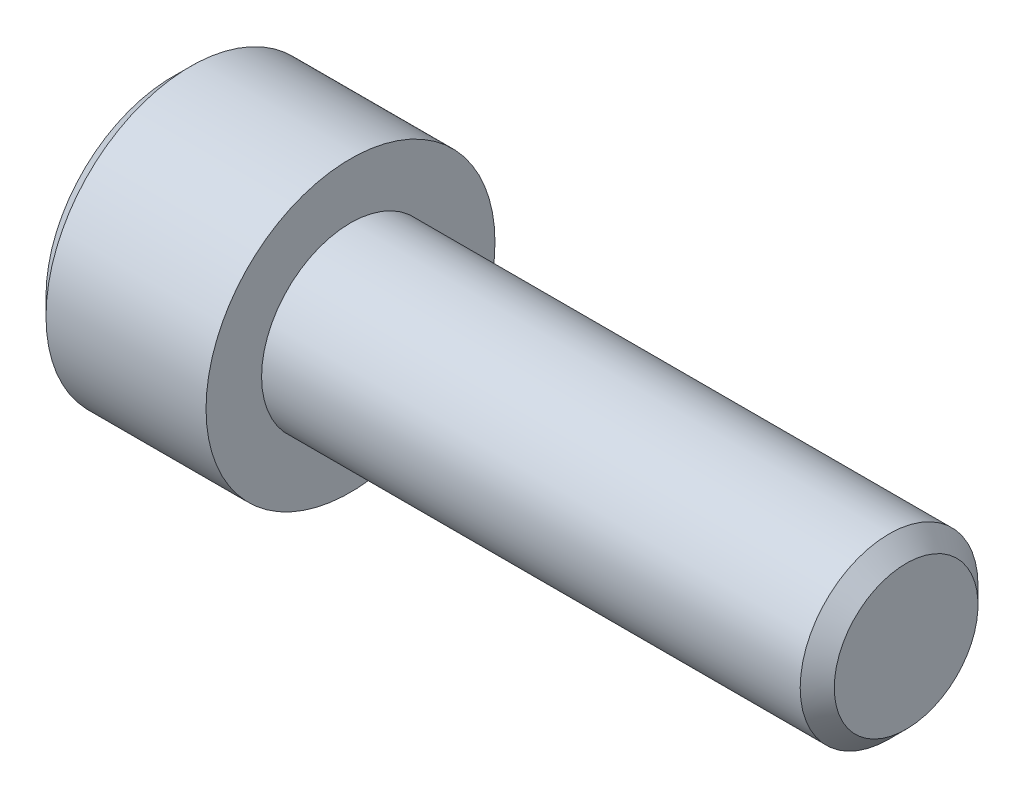
ISO-10303-21;
HEADER;
FILE_DESCRIPTION(('STEP AP214'),'2;1');
FILE_NAME('part.step','',(''),(''),'','','');
FILE_SCHEMA(('AUTOMOTIVE_DESIGN { 1 0 10303 214 1 1 1 1 }'));
ENDSEC;
DATA;
#1=APPLICATION_CONTEXT('core data for automotive mechanical design processes');
#2=APPLICATION_PROTOCOL_DEFINITION('international standard','automotive_design',2000,#1);
#3=PRODUCT_CONTEXT('',#1,'mechanical');
#4=PRODUCT('Part','Part','',(#3));
#5=PRODUCT_RELATED_PRODUCT_CATEGORY('part','',(#4));
#6=PRODUCT_DEFINITION_FORMATION('','',#4);
#7=PRODUCT_DEFINITION_CONTEXT('part definition',#1,'design');
#8=PRODUCT_DEFINITION('design','',#6,#7);
#9=PRODUCT_DEFINITION_SHAPE('','',#8);
#10=(LENGTH_UNIT() NAMED_UNIT(*) SI_UNIT(.MILLI.,.METRE.));
#11=(NAMED_UNIT(*) PLANE_ANGLE_UNIT() SI_UNIT($,.RADIAN.));
#12=(NAMED_UNIT(*) SI_UNIT($,.STERADIAN.) SOLID_ANGLE_UNIT());
#13=UNCERTAINTY_MEASURE_WITH_UNIT(LENGTH_MEASURE(1.E-05),#10,'distance_accuracy_value','');
#14=(GEOMETRIC_REPRESENTATION_CONTEXT(3) GLOBAL_UNCERTAINTY_ASSIGNED_CONTEXT((#13)) GLOBAL_UNIT_ASSIGNED_CONTEXT((#10,
#11,#12)) REPRESENTATION_CONTEXT('',''));
#15=CARTESIAN_POINT('',(0.,0.,0.));
#16=DIRECTION('',(0.,0.,1.));
#17=DIRECTION('',(1.,0.,0.));
#18=AXIS2_PLACEMENT_3D('',#15,#16,#17);
#19=CARTESIAN_POINT('',(-4.,0.,0.));
#20=DIRECTION('',(1.,0.,0.));
#21=DIRECTION('',(0.,0.,-1.));
#22=AXIS2_PLACEMENT_3D('',#19,#20,#21);
#23=PLANE('',#22);
#24=DIRECTION('',(0.,1.,0.));
#25=VECTOR('',#24,1.);
#26=CARTESIAN_POINT('',(-4.,0.,3.));
#27=LINE('',#26,#25);
#28=CARTESIAN_POINT('',(-4.,1.73205080756888,3.));
#29=VERTEX_POINT('',#28);
#30=CARTESIAN_POINT('',(-3.99999999999534,0.,2.99999999999295));
#31=VERTEX_POINT('',#30);
#32=EDGE_CURVE('E109',#29,#31,#27,.F.);
#33=ORIENTED_EDGE('',*,*,#32,.F.);
#34=DIRECTION('',(0.,-0.500000000000001,0.866025403784438));
#35=VECTOR('',#34,1.);
#36=CARTESIAN_POINT('',(-4.,2.59807621135332,1.5));
#37=LINE('',#36,#35);
#38=CARTESIAN_POINT('',(-3.99999999999534,2.59807621134721,1.49999999999647));
#39=VERTEX_POINT('',#38);
#40=EDGE_CURVE('E93',#39,#29,#37,.T.);
#41=ORIENTED_EDGE('',*,*,#40,.F.);
#42=CARTESIAN_POINT('',(-3.99999999999068,0.,0.));
#43=DIRECTION('',(-1.,0.,0.));
#44=DIRECTION('',(0.,0.,1.));
#45=AXIS2_PLACEMENT_3D('',#42,#43,#44);
#46=CIRCLE('',#45,2.9999999999859);
#47=EDGE_CURVE('E20',#39,#31,#46,.F.);
#48=ORIENTED_EDGE('',*,*,#47,.T.);
#49=EDGE_LOOP('',(#33,#41,#48));
#50=FACE_BOUND('',#49,.T.);
#51=ADVANCED_FACE('F17',(#50),#23,.F.);
#52=CARTESIAN_POINT('',(-4.,0.,0.));
#53=DIRECTION('',(1.,0.,0.));
#54=DIRECTION('',(0.,0.,-1.));
#55=AXIS2_PLACEMENT_3D('',#52,#53,#54);
#56=PLANE('',#55);
#57=DIRECTION('',(0.,0.499999999999996,-0.866025403784441));
#58=VECTOR('',#57,1.);
#59=CARTESIAN_POINT('',(-4.,-3.46410161513775,0.));
#60=LINE('',#59,#58);
#61=CARTESIAN_POINT('',(-4.,-3.46410161513775,0.));
#62=VERTEX_POINT('',#61);
#63=CARTESIAN_POINT('',(-3.99999999999534,-2.59807621134721,-1.49999999999648));
#64=VERTEX_POINT('',#63);
#65=EDGE_CURVE('E149',#62,#64,#60,.T.);
#66=ORIENTED_EDGE('',*,*,#65,.F.);
#67=DIRECTION('',(0.,-0.499999999999996,-0.866025403784441));
#68=VECTOR('',#67,1.);
#69=CARTESIAN_POINT('',(-4.,-2.59807621135332,1.5));
#70=LINE('',#69,#68);
#71=CARTESIAN_POINT('',(-3.99999999999534,-2.59807621134721,1.49999999999647));
#72=VERTEX_POINT('',#71);
#73=EDGE_CURVE('E153',#72,#62,#70,.T.);
#74=ORIENTED_EDGE('',*,*,#73,.F.);
#75=CARTESIAN_POINT('',(-3.99999999999068,0.,0.));
#76=DIRECTION('',(-1.,0.,0.));
#77=DIRECTION('',(0.,0.,1.));
#78=AXIS2_PLACEMENT_3D('',#75,#76,#77);
#79=CIRCLE('',#78,2.9999999999859);
#80=EDGE_CURVE('E123',#72,#64,#79,.F.);
#81=ORIENTED_EDGE('',*,*,#80,.T.);
#82=EDGE_LOOP('',(#66,#74,#81));
#83=FACE_BOUND('',#82,.T.);
#84=ADVANCED_FACE('F420',(#83),#56,.F.);
#85=CARTESIAN_POINT('',(-4.,0.,0.));
#86=DIRECTION('',(1.,0.,0.));
#87=DIRECTION('',(0.,0.,-1.));
#88=AXIS2_PLACEMENT_3D('',#85,#86,#87);
#89=PLANE('',#88);
#90=DIRECTION('',(0.,1.,0.));
#91=VECTOR('',#90,1.);
#92=CARTESIAN_POINT('',(-4.,0.,-3.));
#93=LINE('',#92,#91);
#94=CARTESIAN_POINT('',(-4.,-1.73205080756888,-3.));
#95=VERTEX_POINT('',#94);
#96=CARTESIAN_POINT('',(-3.99999999999534,0.,-2.99999999999295));
#97=VERTEX_POINT('',#96);
#98=EDGE_CURVE('E141',#95,#97,#93,.T.);
#99=ORIENTED_EDGE('',*,*,#98,.F.);
#100=DIRECTION('',(0.,0.500000000000001,-0.866025403784438));
#101=VECTOR('',#100,1.);
#102=CARTESIAN_POINT('',(-4.,-2.59807621135332,-1.5));
#103=LINE('',#102,#101);
#104=EDGE_CURVE('E145',#64,#95,#103,.T.);
#105=ORIENTED_EDGE('',*,*,#104,.F.);
#106=CARTESIAN_POINT('',(-3.99999999999068,0.,0.));
#107=DIRECTION('',(-1.,0.,0.));
#108=DIRECTION('',(0.,0.,1.));
#109=AXIS2_PLACEMENT_3D('',#106,#107,#108);
#110=CIRCLE('',#109,2.9999999999859);
#111=EDGE_CURVE('E125',#64,#97,#110,.F.);
#112=ORIENTED_EDGE('',*,*,#111,.T.);
#113=EDGE_LOOP('',(#99,#105,#112));
#114=FACE_BOUND('',#113,.T.);
#115=ADVANCED_FACE('F207',(#114),#89,.F.);
#116=CARTESIAN_POINT('',(-4.,0.,0.));
#117=DIRECTION('',(1.,0.,0.));
#118=DIRECTION('',(0.,0.,-1.));
#119=AXIS2_PLACEMENT_3D('',#116,#117,#118);
#120=PLANE('',#119);
#121=DIRECTION('',(0.,0.500000000000001,0.866025403784438));
#122=VECTOR('',#121,1.);
#123=CARTESIAN_POINT('',(-4.,1.73205080756888,-3.));
#124=LINE('',#123,#122);
#125=CARTESIAN_POINT('',(-4.,1.73205080756888,-3.));
#126=VERTEX_POINT('',#125);
#127=CARTESIAN_POINT('',(-3.99999999999534,2.59807621134721,-1.49999999999647));
#128=VERTEX_POINT('',#127);
#129=EDGE_CURVE('E101',#126,#128,#124,.T.);
#130=ORIENTED_EDGE('',*,*,#129,.F.);
#131=DIRECTION('',(0.,1.,0.));
#132=VECTOR('',#131,1.);
#133=CARTESIAN_POINT('',(-4.,0.,-3.));
#134=LINE('',#133,#132);
#135=EDGE_CURVE('E137',#97,#126,#134,.T.);
#136=ORIENTED_EDGE('',*,*,#135,.F.);
#137=CARTESIAN_POINT('',(-3.99999999999068,0.,0.));
#138=DIRECTION('',(-1.,0.,0.));
#139=DIRECTION('',(0.,0.,1.));
#140=AXIS2_PLACEMENT_3D('',#137,#138,#139);
#141=CIRCLE('',#140,2.9999999999859);
#142=EDGE_CURVE('E117',#97,#128,#141,.F.);
#143=ORIENTED_EDGE('',*,*,#142,.T.);
#144=EDGE_LOOP('',(#130,#136,#143));
#145=FACE_BOUND('',#144,.T.);
#146=ADVANCED_FACE('F210',(#145),#120,.F.);
#147=CARTESIAN_POINT('',(-4.,0.,0.));
#148=DIRECTION('',(1.,0.,0.));
#149=DIRECTION('',(0.,0.,-1.));
#150=AXIS2_PLACEMENT_3D('',#147,#148,#149);
#151=PLANE('',#150);
#152=CARTESIAN_POINT('',(-3.99999999999068,0.,0.));
#153=DIRECTION('',(-1.,0.,0.));
#154=DIRECTION('',(0.,0.,1.));
#155=AXIS2_PLACEMENT_3D('',#152,#153,#154);
#156=CIRCLE('',#155,2.9999999999859);
#157=EDGE_CURVE('E112',#128,#39,#156,.F.);
#158=ORIENTED_EDGE('',*,*,#157,.T.);
#159=DIRECTION('',(0.,-0.499999999999996,0.866025403784441));
#160=VECTOR('',#159,1.);
#161=CARTESIAN_POINT('',(-4.,3.46410161513775,0.));
#162=LINE('',#161,#160);
#163=CARTESIAN_POINT('',(-4.,3.46410161513775,0.));
#164=VERTEX_POINT('',#163);
#165=EDGE_CURVE('E89',#164,#39,#162,.T.);
#166=ORIENTED_EDGE('',*,*,#165,.F.);
#167=DIRECTION('',(0.,0.499999999999996,0.866025403784441));
#168=VECTOR('',#167,1.);
#169=CARTESIAN_POINT('',(-4.,2.59807621135332,-1.5));
#170=LINE('',#169,#168);
#171=EDGE_CURVE('E100',#128,#164,#170,.T.);
#172=ORIENTED_EDGE('',*,*,#171,.F.);
#173=EDGE_LOOP('',(#158,#166,#172));
#174=FACE_BOUND('',#173,.T.);
#175=ADVANCED_FACE('F113',(#174),#151,.F.);
#176=CARTESIAN_POINT('',(-3.99999999999068,0.,0.));
#177=DIRECTION('',(-1.,0.,0.));
#178=DIRECTION('',(0.,0.,1.));
#179=AXIS2_PLACEMENT_3D('',#176,#177,#178);
#180=CONICAL_SURFACE('',#179,2.9999999999859,1.30899693900041);
#181=CARTESIAN_POINT('',(-3.1961524227313,0.,5.6843418860808E-11));
#182=VERTEX_POINT('',#181);
#183=VERTEX_LOOP('',#182);
#184=FACE_BOUND('',#183,.T.);
#185=ORIENTED_EDGE('',*,*,#142,.F.);
#186=ORIENTED_EDGE('',*,*,#111,.F.);
#187=ORIENTED_EDGE('',*,*,#80,.F.);
#188=CARTESIAN_POINT('',(-3.99999999999068,0.,0.));
#189=DIRECTION('',(-1.,0.,0.));
#190=DIRECTION('',(0.,0.,1.));
#191=AXIS2_PLACEMENT_3D('',#188,#189,#190);
#192=CIRCLE('',#191,2.9999999999859);
#193=EDGE_CURVE('E116',#72,#31,#192,.T.);
#194=ORIENTED_EDGE('',*,*,#193,.T.);
#195=ORIENTED_EDGE('',*,*,#47,.F.);
#196=ORIENTED_EDGE('',*,*,#157,.F.);
#197=EDGE_LOOP('',(#185,#186,#187,#194,#195,#196));
#198=FACE_BOUND('',#197,.T.);
#199=ADVANCED_FACE('F119',(#184,#198),#180,.F.);
#200=CARTESIAN_POINT('',(-4.,0.,0.));
#201=DIRECTION('',(1.,0.,0.));
#202=DIRECTION('',(0.,0.,-1.));
#203=AXIS2_PLACEMENT_3D('',#200,#201,#202);
#204=PLANE('',#203);
#205=DIRECTION('',(0.,0.5,0.866025403784439));
#206=VECTOR('',#205,1.);
#207=CARTESIAN_POINT('',(-4.,-1.73205080756888,3.));
#208=LINE('',#207,#206);
#209=CARTESIAN_POINT('',(-4.,-1.73205080756888,3.));
#210=VERTEX_POINT('',#209);
#211=EDGE_CURVE('E197',#210,#72,#208,.F.);
#212=ORIENTED_EDGE('',*,*,#211,.F.);
#213=DIRECTION('',(0.,1.,0.));
#214=VECTOR('',#213,1.);
#215=CARTESIAN_POINT('',(-4.,1.73205080756888,3.));
#216=LINE('',#215,#214);
#217=EDGE_CURVE('E227',#31,#210,#216,.F.);
#218=ORIENTED_EDGE('',*,*,#217,.F.);
#219=ORIENTED_EDGE('',*,*,#193,.F.);
#220=EDGE_LOOP('',(#212,#218,#219));
#221=FACE_BOUND('',#220,.T.);
#222=ADVANCED_FACE('F240',(#221),#204,.F.);
#223=CARTESIAN_POINT('',(-4.,-1.73205080756888,3.));
#224=DIRECTION('',(0.,0.866025403784439,-0.5));
#225=DIRECTION('',(0.,0.5,0.866025403784439));
#226=AXIS2_PLACEMENT_3D('',#223,#224,#225);
#227=PLANE('',#226);
#228=ORIENTED_EDGE('',*,*,#73,.T.);
#229=DIRECTION('',(1.,0.,0.));
#230=VECTOR('',#229,1.);
#231=CARTESIAN_POINT('',(-4.,-3.46410161513775,0.));
#232=LINE('',#231,#230);
#233=CARTESIAN_POINT('',(-8.,-3.46410161513775,0.));
#234=VERTEX_POINT('',#233);
#235=EDGE_CURVE('E170',#234,#62,#232,.T.);
#236=ORIENTED_EDGE('',*,*,#235,.F.);
#237=DIRECTION('',(0.,0.499999999999998,0.86602540378444));
#238=VECTOR('',#237,1.);
#239=CARTESIAN_POINT('',(-8.,-3.46410161513775,0.));
#240=LINE('',#239,#238);
#241=CARTESIAN_POINT('',(-8.,-1.73205080756888,3.));
#242=VERTEX_POINT('',#241);
#243=EDGE_CURVE('E175',#234,#242,#240,.T.);
#244=ORIENTED_EDGE('',*,*,#243,.T.);
#245=DIRECTION('',(-1.,0.,0.));
#246=VECTOR('',#245,1.);
#247=CARTESIAN_POINT('',(-4.,-1.73205080756888,3.));
#248=LINE('',#247,#246);
#249=EDGE_CURVE('E183',#210,#242,#248,.T.);
#250=ORIENTED_EDGE('',*,*,#249,.F.);
#251=ORIENTED_EDGE('',*,*,#211,.T.);
#252=EDGE_LOOP('',(#228,#236,#244,#250,#251));
#253=FACE_BOUND('',#252,.T.);
#254=ADVANCED_FACE('F238',(#253),#227,.T.);
#255=CARTESIAN_POINT('',(-4.,1.73205080756888,3.));
#256=DIRECTION('',(0.,0.,-1.));
#257=DIRECTION('',(-1.,0.,0.));
#258=AXIS2_PLACEMENT_3D('',#255,#256,#257);
#259=PLANE('',#258);
#260=ORIENTED_EDGE('',*,*,#217,.T.);
#261=ORIENTED_EDGE('',*,*,#249,.T.);
#262=DIRECTION('',(0.,1.,0.));
#263=VECTOR('',#262,1.);
#264=CARTESIAN_POINT('',(-8.,0.,3.));
#265=LINE('',#264,#263);
#266=CARTESIAN_POINT('',(-8.,1.73205080756888,3.));
#267=VERTEX_POINT('',#266);
#268=EDGE_CURVE('E221',#242,#267,#265,.T.);
#269=ORIENTED_EDGE('',*,*,#268,.T.);
#270=DIRECTION('',(1.,0.,0.));
#271=VECTOR('',#270,1.);
#272=CARTESIAN_POINT('',(-4.,1.73205080756887,3.));
#273=LINE('',#272,#271);
#274=EDGE_CURVE('E166',#29,#267,#273,.F.);
#275=ORIENTED_EDGE('',*,*,#274,.F.);
#276=ORIENTED_EDGE('',*,*,#32,.T.);
#277=EDGE_LOOP('',(#260,#261,#269,#275,#276));
#278=FACE_BOUND('',#277,.T.);
#279=ADVANCED_FACE('F242',(#278),#259,.T.);
#280=CARTESIAN_POINT('',(-4.,3.46410161513775,0.));
#281=DIRECTION('',(0.,-0.866025403784439,-0.5));
#282=DIRECTION('',(0.,0.5,-0.866025403784439));
#283=AXIS2_PLACEMENT_3D('',#280,#281,#282);
#284=PLANE('',#283);
#285=ORIENTED_EDGE('',*,*,#40,.T.);
#286=ORIENTED_EDGE('',*,*,#274,.T.);
#287=DIRECTION('',(0.,0.499999999999998,-0.86602540378444));
#288=VECTOR('',#287,1.);
#289=CARTESIAN_POINT('',(-8.,1.73205080756888,3.));
#290=LINE('',#289,#288);
#291=CARTESIAN_POINT('',(-8.,3.46410161513775,0.));
#292=VERTEX_POINT('',#291);
#293=EDGE_CURVE('E218',#267,#292,#290,.T.);
#294=ORIENTED_EDGE('',*,*,#293,.T.);
#295=DIRECTION('',(1.,0.,0.));
#296=VECTOR('',#295,1.);
#297=CARTESIAN_POINT('',(-4.,3.46410161513776,0.));
#298=LINE('',#297,#296);
#299=EDGE_CURVE('E96',#164,#292,#298,.F.);
#300=ORIENTED_EDGE('',*,*,#299,.F.);
#301=ORIENTED_EDGE('',*,*,#165,.T.);
#302=EDGE_LOOP('',(#285,#286,#294,#300,#301));
#303=FACE_BOUND('',#302,.T.);
#304=ADVANCED_FACE('F91',(#303),#284,.T.);
#305=CARTESIAN_POINT('',(-4.,1.73205080756888,-3.));
#306=DIRECTION('',(0.,-0.866025403784439,0.5));
#307=DIRECTION('',(0.,-0.5,-0.866025403784439));
#308=AXIS2_PLACEMENT_3D('',#305,#306,#307);
#309=PLANE('',#308);
#310=ORIENTED_EDGE('',*,*,#171,.T.);
#311=ORIENTED_EDGE('',*,*,#299,.T.);
#312=DIRECTION('',(0.,-0.499999999999998,-0.86602540378444));
#313=VECTOR('',#312,1.);
#314=CARTESIAN_POINT('',(-8.,3.46410161513775,0.));
#315=LINE('',#314,#313);
#316=CARTESIAN_POINT('',(-8.,1.73205080756888,-3.));
#317=VERTEX_POINT('',#316);
#318=EDGE_CURVE('E215',#292,#317,#315,.T.);
#319=ORIENTED_EDGE('',*,*,#318,.T.);
#320=DIRECTION('',(1.,0.,0.));
#321=VECTOR('',#320,1.);
#322=CARTESIAN_POINT('',(-4.,1.73205080756888,-3.));
#323=LINE('',#322,#321);
#324=EDGE_CURVE('E165',#126,#317,#323,.F.);
#325=ORIENTED_EDGE('',*,*,#324,.F.);
#326=ORIENTED_EDGE('',*,*,#129,.T.);
#327=EDGE_LOOP('',(#310,#311,#319,#325,#326));
#328=FACE_BOUND('',#327,.T.);
#329=ADVANCED_FACE('F213',(#328),#309,.T.);
#330=CARTESIAN_POINT('',(-4.,-1.73205080756888,-3.));
#331=DIRECTION('',(0.,0.,1.));
#332=DIRECTION('',(1.,0.,0.));
#333=AXIS2_PLACEMENT_3D('',#330,#331,#332);
#334=PLANE('',#333);
#335=ORIENTED_EDGE('',*,*,#135,.T.);
#336=ORIENTED_EDGE('',*,*,#324,.T.);
#337=DIRECTION('',(0.,1.,0.));
#338=VECTOR('',#337,1.);
#339=CARTESIAN_POINT('',(-8.,0.,-3.));
#340=LINE('',#339,#338);
#341=CARTESIAN_POINT('',(-8.,-1.73205080756888,-3.));
#342=VERTEX_POINT('',#341);
#343=EDGE_CURVE('E35',#317,#342,#340,.F.);
#344=ORIENTED_EDGE('',*,*,#343,.T.);
#345=DIRECTION('',(1.,0.,0.));
#346=VECTOR('',#345,1.);
#347=CARTESIAN_POINT('',(-4.,-1.73205080756887,-3.));
#348=LINE('',#347,#346);
#349=EDGE_CURVE('E173',#95,#342,#348,.F.);
#350=ORIENTED_EDGE('',*,*,#349,.F.);
#351=ORIENTED_EDGE('',*,*,#98,.T.);
#352=EDGE_LOOP('',(#335,#336,#344,#350,#351));
#353=FACE_BOUND('',#352,.T.);
#354=ADVANCED_FACE('F212',(#353),#334,.T.);
#355=CARTESIAN_POINT('',(-4.,-3.46410161513775,0.));
#356=DIRECTION('',(0.,0.866025403784439,0.5));
#357=DIRECTION('',(0.,-0.5,0.866025403784439));
#358=AXIS2_PLACEMENT_3D('',#355,#356,#357);
#359=PLANE('',#358);
#360=ORIENTED_EDGE('',*,*,#104,.T.);
#361=ORIENTED_EDGE('',*,*,#349,.T.);
#362=DIRECTION('',(0.,-0.499999999999998,0.86602540378444));
#363=VECTOR('',#362,1.);
#364=CARTESIAN_POINT('',(-8.,-1.73205080756888,-3.));
#365=LINE('',#364,#363);
#366=EDGE_CURVE('E196',#342,#234,#365,.T.);
#367=ORIENTED_EDGE('',*,*,#366,.T.);
#368=ORIENTED_EDGE('',*,*,#235,.T.);
#369=ORIENTED_EDGE('',*,*,#65,.T.);
#370=EDGE_LOOP('',(#360,#361,#367,#368,#369));
#371=FACE_BOUND('',#370,.T.);
#372=ADVANCED_FACE('F251',(#371),#359,.T.);
#373=CARTESIAN_POINT('',(-8.,0.,0.));
#374=DIRECTION('',(1.,0.,0.));
#375=DIRECTION('',(0.,0.,-1.));
#376=AXIS2_PLACEMENT_3D('',#373,#374,#375);
#377=PLANE('',#376);
#378=ORIENTED_EDGE('',*,*,#343,.F.);
#379=ORIENTED_EDGE('',*,*,#318,.F.);
#380=ORIENTED_EDGE('',*,*,#293,.F.);
#381=ORIENTED_EDGE('',*,*,#268,.F.);
#382=ORIENTED_EDGE('',*,*,#243,.F.);
#383=ORIENTED_EDGE('',*,*,#366,.F.);
#384=EDGE_LOOP('',(#378,#379,#380,#381,#382,#383));
#385=FACE_BOUND('',#384,.T.);
#386=CARTESIAN_POINT('',(-8.0000000000382,0.,0.));
#387=DIRECTION('',(1.,0.,0.));
#388=DIRECTION('',(0.,0.,-1.));
#389=AXIS2_PLACEMENT_3D('',#386,#387,#388);
#390=CIRCLE('',#389,5.69999999993342);
#391=CARTESIAN_POINT('',(-8.0000000000382,0.,-5.69999999993342));
#392=VERTEX_POINT('',#391);
#393=EDGE_CURVE('E193',#392,#392,#390,.T.);
#394=ORIENTED_EDGE('',*,*,#393,.F.);
#395=EDGE_LOOP('',(#394));
#396=FACE_BOUND('',#395,.T.);
#397=ADVANCED_FACE('F244',(#385,#396),#377,.F.);
#398=CARTESIAN_POINT('',(-7.20000000006848,0.,0.));
#399=DIRECTION('',(1.,0.,0.));
#400=DIRECTION('',(0.,0.,-1.));
#401=AXIS2_PLACEMENT_3D('',#398,#399,#400);
#402=CONICAL_SURFACE('',#401,6.49999999990314,0.785398163397448);
#403=ORIENTED_EDGE('',*,*,#393,.T.);
#404=EDGE_LOOP('',(#403));
#405=FACE_BOUND('',#404,.T.);
#406=CARTESIAN_POINT('',(-7.2,0.,0.));
#407=DIRECTION('',(-1.,0.,0.));
#408=DIRECTION('',(0.,0.,1.));
#409=AXIS2_PLACEMENT_3D('',#406,#407,#408);
#410=CIRCLE('',#409,6.5);
#411=CARTESIAN_POINT('',(-7.2,0.,6.5));
#412=VERTEX_POINT('',#411);
#413=EDGE_CURVE('E192',#412,#412,#410,.F.);
#414=ORIENTED_EDGE('',*,*,#413,.F.);
#415=EDGE_LOOP('',(#414));
#416=FACE_BOUND('',#415,.T.);
#417=ADVANCED_FACE('F274',(#405,#416),#402,.T.);
#418=CARTESIAN_POINT('',(25.,3.233,0.));
#419=DIRECTION('',(-1.,0.,0.));
#420=DIRECTION('',(0.,0.,1.));
#421=AXIS2_PLACEMENT_3D('',#418,#419,#420);
#422=PLANE('',#421);
#423=CARTESIAN_POINT('',(24.9999999999773,0.,0.));
#424=DIRECTION('',(-1.,0.,0.));
#425=DIRECTION('',(0.,0.,1.));
#426=AXIS2_PLACEMENT_3D('',#423,#424,#425);
#427=CIRCLE('',#426,3.23299999996607);
#428=CARTESIAN_POINT('',(24.9999999999773,0.,3.23299999996607));
#429=VERTEX_POINT('',#428);
#430=EDGE_CURVE('E189',#429,#429,#427,.T.);
#431=ORIENTED_EDGE('',*,*,#430,.F.);
#432=EDGE_LOOP('',(#431));
#433=FACE_BOUND('',#432,.T.);
#434=ADVANCED_FACE('F272',(#433),#422,.F.);
#435=CARTESIAN_POINT('',(25.,0.,0.));
#436=DIRECTION('',(-1.,0.,0.));
#437=DIRECTION('',(0.,0.,1.));
#438=AXIS2_PLACEMENT_3D('',#435,#436,#437);
#439=CYLINDRICAL_SURFACE('',#438,6.5);
#440=ORIENTED_EDGE('',*,*,#413,.T.);
#441=EDGE_LOOP('',(#440));
#442=FACE_BOUND('',#441,.T.);
#443=CARTESIAN_POINT('',(0.,0.,0.));
#444=DIRECTION('',(-1.,0.,0.));
#445=DIRECTION('',(0.,0.,1.));
#446=AXIS2_PLACEMENT_3D('',#443,#444,#445);
#447=CIRCLE('',#446,6.5);
#448=CARTESIAN_POINT('',(0.,0.,6.5));
#449=VERTEX_POINT('',#448);
#450=EDGE_CURVE('E186',#449,#449,#447,.T.);
#451=ORIENTED_EDGE('',*,*,#450,.T.);
#452=EDGE_LOOP('',(#451));
#453=FACE_BOUND('',#452,.T.);
#454=ADVANCED_FACE('F268',(#442,#453),#439,.T.);
#455=CARTESIAN_POINT('',(24.2329999999811,0.,0.));
#456=DIRECTION('',(-1.,0.,0.));
#457=DIRECTION('',(0.,0.,1.));
#458=AXIS2_PLACEMENT_3D('',#455,#456,#457);
#459=CONICAL_SURFACE('',#458,4.0000000000191,0.785398163434504);
#460=CARTESIAN_POINT('',(24.233,0.,0.));
#461=DIRECTION('',(-1.,0.,0.));
#462=DIRECTION('',(0.,0.,1.));
#463=AXIS2_PLACEMENT_3D('',#460,#461,#462);
#464=CIRCLE('',#463,4.);
#465=CARTESIAN_POINT('',(24.233,0.,4.));
#466=VERTEX_POINT('',#465);
#467=EDGE_CURVE('E26',#466,#466,#464,.T.);
#468=ORIENTED_EDGE('',*,*,#467,.F.);
#469=EDGE_LOOP('',(#468));
#470=FACE_BOUND('',#469,.T.);
#471=ORIENTED_EDGE('',*,*,#430,.T.);
#472=EDGE_LOOP('',(#471));
#473=FACE_BOUND('',#472,.T.);
#474=ADVANCED_FACE('F264',(#470,#473),#459,.T.);
#475=CARTESIAN_POINT('',(0.,6.5,0.));
#476=DIRECTION('',(-1.,0.,0.));
#477=DIRECTION('',(0.,0.,1.));
#478=AXIS2_PLACEMENT_3D('',#475,#476,#477);
#479=PLANE('',#478);
#480=ORIENTED_EDGE('',*,*,#450,.F.);
#481=EDGE_LOOP('',(#480));
#482=FACE_BOUND('',#481,.T.);
#483=CARTESIAN_POINT('',(0.,0.,0.));
#484=DIRECTION('',(-1.,0.,0.));
#485=DIRECTION('',(0.,0.,1.));
#486=AXIS2_PLACEMENT_3D('',#483,#484,#485);
#487=CIRCLE('',#486,4.);
#488=CARTESIAN_POINT('',(0.,0.,4.));
#489=VERTEX_POINT('',#488);
#490=EDGE_CURVE('E11',#489,#489,#487,.F.);
#491=ORIENTED_EDGE('',*,*,#490,.F.);
#492=EDGE_LOOP('',(#491));
#493=FACE_BOUND('',#492,.T.);
#494=ADVANCED_FACE('F267',(#482,#493),#479,.F.);
#495=CARTESIAN_POINT('',(25.,0.,0.));
#496=DIRECTION('',(-1.,0.,0.));
#497=DIRECTION('',(0.,0.,1.));
#498=AXIS2_PLACEMENT_3D('',#495,#496,#497);
#499=CYLINDRICAL_SURFACE('',#498,4.);
#500=ORIENTED_EDGE('',*,*,#490,.T.);
#501=EDGE_LOOP('',(#500));
#502=FACE_BOUND('',#501,.T.);
#503=ORIENTED_EDGE('',*,*,#467,.T.);
#504=EDGE_LOOP('',(#503));
#505=FACE_BOUND('',#504,.T.);
#506=ADVANCED_FACE('F262',(#502,#505),#499,.T.);
#507=CLOSED_SHELL('',(#51,#84,#115,#146,#175,#199,#222,#254,#279,#304,#329,#354,#372,#397,#417,
#434,#454,#474,#494,#506));
#508=MANIFOLD_SOLID_BREP('B1',#507);
#509=ADVANCED_BREP_SHAPE_REPRESENTATION('',(#18,#508),#14);
#510=SHAPE_DEFINITION_REPRESENTATION(#9,#509);
ENDSEC;
END-ISO-10303-21;
